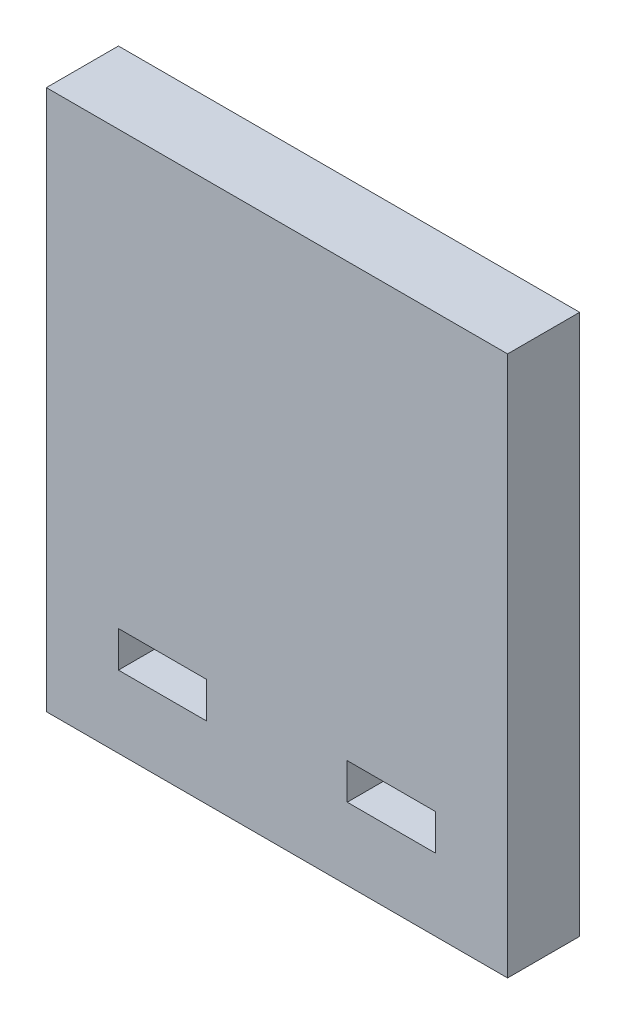
ISO-10303-21;
HEADER;
FILE_DESCRIPTION(('STEP AP214'),'2;1');
FILE_NAME('part.step','',(''),(''),'','','');
FILE_SCHEMA(('AUTOMOTIVE_DESIGN { 1 0 10303 214 1 1 1 1 }'));
ENDSEC;
DATA;
#1=APPLICATION_CONTEXT('core data for automotive mechanical design processes');
#2=APPLICATION_PROTOCOL_DEFINITION('international standard','automotive_design',2000,#1);
#3=PRODUCT_CONTEXT('',#1,'mechanical');
#4=PRODUCT('Part','Part','',(#3));
#5=PRODUCT_RELATED_PRODUCT_CATEGORY('part','',(#4));
#6=PRODUCT_DEFINITION_FORMATION('','',#4);
#7=PRODUCT_DEFINITION_CONTEXT('part definition',#1,'design');
#8=PRODUCT_DEFINITION('design','',#6,#7);
#9=PRODUCT_DEFINITION_SHAPE('','',#8);
#10=(LENGTH_UNIT() NAMED_UNIT(*) SI_UNIT(.MILLI.,.METRE.));
#11=(NAMED_UNIT(*) PLANE_ANGLE_UNIT() SI_UNIT($,.RADIAN.));
#12=(NAMED_UNIT(*) SI_UNIT($,.STERADIAN.) SOLID_ANGLE_UNIT());
#13=UNCERTAINTY_MEASURE_WITH_UNIT(LENGTH_MEASURE(1.E-05),#10,'distance_accuracy_value','');
#14=(GEOMETRIC_REPRESENTATION_CONTEXT(3) GLOBAL_UNCERTAINTY_ASSIGNED_CONTEXT((#13)) GLOBAL_UNIT_ASSIGNED_CONTEXT((#10,
#11,#12)) REPRESENTATION_CONTEXT('',''));
#15=CARTESIAN_POINT('',(0.,0.,0.));
#16=DIRECTION('',(0.,0.,1.));
#17=DIRECTION('',(1.,0.,0.));
#18=AXIS2_PLACEMENT_3D('',#15,#16,#17);
#19=CARTESIAN_POINT('',(0.,0.,20.));
#20=DIRECTION('',(0.,0.,-1.));
#21=DIRECTION('',(-1.,0.,0.));
#22=AXIS2_PLACEMENT_3D('',#19,#20,#21);
#23=PLANE('',#22);
#24=DIRECTION('',(0.,1.,0.));
#25=VECTOR('',#24,1.);
#26=CARTESIAN_POINT('',(44.,-55.,20.));
#27=LINE('',#26,#25);
#28=CARTESIAN_POINT('',(44.,-55.,20.));
#29=VERTEX_POINT('',#28);
#30=CARTESIAN_POINT('',(44.,-45.,20.));
#31=VERTEX_POINT('',#30);
#32=EDGE_CURVE('E183',#29,#31,#27,.T.);
#33=ORIENTED_EDGE('',*,*,#32,.F.);
#34=DIRECTION('',(1.,0.,0.));
#35=VECTOR('',#34,1.);
#36=CARTESIAN_POINT('',(44.,-55.,20.));
#37=LINE('',#36,#35);
#38=CARTESIAN_POINT('',(19.5,-55.,20.));
#39=VERTEX_POINT('',#38);
#40=EDGE_CURVE('E194',#39,#29,#37,.T.);
#41=ORIENTED_EDGE('',*,*,#40,.F.);
#42=DIRECTION('',(0.,-1.,0.));
#43=VECTOR('',#42,1.);
#44=CARTESIAN_POINT('',(19.5,-55.,20.));
#45=LINE('',#44,#43);
#46=CARTESIAN_POINT('',(19.5,-45.,20.));
#47=VERTEX_POINT('',#46);
#48=EDGE_CURVE('E190',#47,#39,#45,.T.);
#49=ORIENTED_EDGE('',*,*,#48,.F.);
#50=DIRECTION('',(-1.,0.,0.));
#51=VECTOR('',#50,1.);
#52=CARTESIAN_POINT('',(44.,-45.,20.));
#53=LINE('',#52,#51);
#54=EDGE_CURVE('E186',#31,#47,#53,.T.);
#55=ORIENTED_EDGE('',*,*,#54,.F.);
#56=EDGE_LOOP('',(#33,#41,#49,#55));
#57=FACE_BOUND('',#56,.T.);
#58=DIRECTION('',(0.,1.,0.));
#59=VECTOR('',#58,1.);
#60=CARTESIAN_POINT('',(64.,-75.,20.));
#61=LINE('',#60,#59);
#62=CARTESIAN_POINT('',(64.,-75.,20.));
#63=VERTEX_POINT('',#62);
#64=CARTESIAN_POINT('',(64.,75.,20.));
#65=VERTEX_POINT('',#64);
#66=EDGE_CURVE('E226',#63,#65,#61,.T.);
#67=ORIENTED_EDGE('',*,*,#66,.T.);
#68=DIRECTION('',(-1.,0.,0.));
#69=VECTOR('',#68,1.);
#70=CARTESIAN_POINT('',(-64.,75.,20.));
#71=LINE('',#70,#69);
#72=CARTESIAN_POINT('',(-64.,75.,20.));
#73=VERTEX_POINT('',#72);
#74=EDGE_CURVE('E230',#65,#73,#71,.T.);
#75=ORIENTED_EDGE('',*,*,#74,.T.);
#76=DIRECTION('',(0.,-1.,0.));
#77=VECTOR('',#76,1.);
#78=CARTESIAN_POINT('',(-64.,-75.,20.));
#79=LINE('',#78,#77);
#80=CARTESIAN_POINT('',(-64.,-75.,20.));
#81=VERTEX_POINT('',#80);
#82=EDGE_CURVE('E234',#73,#81,#79,.T.);
#83=ORIENTED_EDGE('',*,*,#82,.T.);
#84=DIRECTION('',(1.,0.,0.));
#85=VECTOR('',#84,1.);
#86=CARTESIAN_POINT('',(-64.,-75.,20.));
#87=LINE('',#86,#85);
#88=EDGE_CURVE('E237',#81,#63,#87,.T.);
#89=ORIENTED_EDGE('',*,*,#88,.T.);
#90=EDGE_LOOP('',(#67,#75,#83,#89));
#91=FACE_BOUND('',#90,.T.);
#92=DIRECTION('',(0.,-1.,0.));
#93=VECTOR('',#92,1.);
#94=CARTESIAN_POINT('',(-43.9999999999996,-55.0000000000002,20.));
#95=LINE('',#94,#93);
#96=CARTESIAN_POINT('',(-43.9999999999996,-45.0000000000002,20.));
#97=VERTEX_POINT('',#96);
#98=CARTESIAN_POINT('',(-43.9999999999996,-55.0000000000002,20.));
#99=VERTEX_POINT('',#98);
#100=EDGE_CURVE('E135',#97,#99,#95,.T.);
#101=ORIENTED_EDGE('',*,*,#100,.F.);
#102=DIRECTION('',(-1.,0.,0.));
#103=VECTOR('',#102,1.);
#104=CARTESIAN_POINT('',(-43.9999999999996,-45.0000000000002,20.));
#105=LINE('',#104,#103);
#106=CARTESIAN_POINT('',(-19.5,-45.,20.));
#107=VERTEX_POINT('',#106);
#108=EDGE_CURVE('E161',#107,#97,#105,.T.);
#109=ORIENTED_EDGE('',*,*,#108,.F.);
#110=DIRECTION('',(0.,1.,0.));
#111=VECTOR('',#110,1.);
#112=CARTESIAN_POINT('',(-19.5,-55.,20.));
#113=LINE('',#112,#111);
#114=CARTESIAN_POINT('',(-19.5,-55.,20.));
#115=VERTEX_POINT('',#114);
#116=EDGE_CURVE('E157',#115,#107,#113,.T.);
#117=ORIENTED_EDGE('',*,*,#116,.F.);
#118=DIRECTION('',(1.,0.,0.));
#119=VECTOR('',#118,1.);
#120=CARTESIAN_POINT('',(-43.9999999999996,-55.0000000000002,20.));
#121=LINE('',#120,#119);
#122=EDGE_CURVE('E144',#99,#115,#121,.T.);
#123=ORIENTED_EDGE('',*,*,#122,.F.);
#124=EDGE_LOOP('',(#101,#109,#117,#123));
#125=FACE_BOUND('',#124,.T.);
#126=ADVANCED_FACE('F45',(#57,#91,#125),#23,.F.);
#127=CARTESIAN_POINT('',(0.,0.,0.));
#128=DIRECTION('',(0.,0.,-1.));
#129=DIRECTION('',(-1.,0.,0.));
#130=AXIS2_PLACEMENT_3D('',#127,#128,#129);
#131=PLANE('',#130);
#132=DIRECTION('',(0.,1.,0.));
#133=VECTOR('',#132,1.);
#134=CARTESIAN_POINT('',(64.,-75.,0.));
#135=LINE('',#134,#133);
#136=CARTESIAN_POINT('',(64.,-75.,0.));
#137=VERTEX_POINT('',#136);
#138=CARTESIAN_POINT('',(64.,75.,0.));
#139=VERTEX_POINT('',#138);
#140=EDGE_CURVE('E225',#137,#139,#135,.T.);
#141=ORIENTED_EDGE('',*,*,#140,.F.);
#142=DIRECTION('',(1.,0.,0.));
#143=VECTOR('',#142,1.);
#144=CARTESIAN_POINT('',(-64.,-75.,0.));
#145=LINE('',#144,#143);
#146=CARTESIAN_POINT('',(-64.,-75.,0.));
#147=VERTEX_POINT('',#146);
#148=EDGE_CURVE('E231',#147,#137,#145,.T.);
#149=ORIENTED_EDGE('',*,*,#148,.F.);
#150=DIRECTION('',(0.,-1.,0.));
#151=VECTOR('',#150,1.);
#152=CARTESIAN_POINT('',(-64.,-75.,0.));
#153=LINE('',#152,#151);
#154=CARTESIAN_POINT('',(-64.,75.,0.));
#155=VERTEX_POINT('',#154);
#156=EDGE_CURVE('E247',#155,#147,#153,.T.);
#157=ORIENTED_EDGE('',*,*,#156,.F.);
#158=DIRECTION('',(-1.,0.,0.));
#159=VECTOR('',#158,1.);
#160=CARTESIAN_POINT('',(-64.,75.,0.));
#161=LINE('',#160,#159);
#162=EDGE_CURVE('E244',#139,#155,#161,.T.);
#163=ORIENTED_EDGE('',*,*,#162,.F.);
#164=EDGE_LOOP('',(#141,#149,#157,#163));
#165=FACE_BOUND('',#164,.T.);
#166=DIRECTION('',(1.,0.,0.));
#167=VECTOR('',#166,1.);
#168=CARTESIAN_POINT('',(44.,-55.,0.));
#169=LINE('',#168,#167);
#170=CARTESIAN_POINT('',(19.5,-55.,0.));
#171=VERTEX_POINT('',#170);
#172=CARTESIAN_POINT('',(44.,-55.,0.));
#173=VERTEX_POINT('',#172);
#174=EDGE_CURVE('E187',#171,#173,#169,.T.);
#175=ORIENTED_EDGE('',*,*,#174,.T.);
#176=DIRECTION('',(0.,1.,0.));
#177=VECTOR('',#176,1.);
#178=CARTESIAN_POINT('',(44.,-55.,0.));
#179=LINE('',#178,#177);
#180=CARTESIAN_POINT('',(44.,-45.,0.));
#181=VERTEX_POINT('',#180);
#182=EDGE_CURVE('E153',#173,#181,#179,.T.);
#183=ORIENTED_EDGE('',*,*,#182,.T.);
#184=DIRECTION('',(-1.,0.,0.));
#185=VECTOR('',#184,1.);
#186=CARTESIAN_POINT('',(44.,-45.,0.));
#187=LINE('',#186,#185);
#188=CARTESIAN_POINT('',(19.5,-45.,0.));
#189=VERTEX_POINT('',#188);
#190=EDGE_CURVE('E201',#181,#189,#187,.T.);
#191=ORIENTED_EDGE('',*,*,#190,.T.);
#192=DIRECTION('',(0.,-1.,0.));
#193=VECTOR('',#192,1.);
#194=CARTESIAN_POINT('',(19.5,-55.,0.));
#195=LINE('',#194,#193);
#196=EDGE_CURVE('E205',#189,#171,#195,.T.);
#197=ORIENTED_EDGE('',*,*,#196,.T.);
#198=EDGE_LOOP('',(#175,#183,#191,#197));
#199=FACE_BOUND('',#198,.T.);
#200=DIRECTION('',(-1.,0.,0.));
#201=VECTOR('',#200,1.);
#202=CARTESIAN_POINT('',(-43.9999999999996,-45.0000000000002,0.));
#203=LINE('',#202,#201);
#204=CARTESIAN_POINT('',(-19.5,-45.,0.));
#205=VERTEX_POINT('',#204);
#206=CARTESIAN_POINT('',(-43.9999999999996,-45.0000000000002,0.));
#207=VERTEX_POINT('',#206);
#208=EDGE_CURVE('E145',#205,#207,#203,.T.);
#209=ORIENTED_EDGE('',*,*,#208,.T.);
#210=DIRECTION('',(0.,-1.,0.));
#211=VECTOR('',#210,1.);
#212=CARTESIAN_POINT('',(-43.9999999999996,-55.0000000000002,0.));
#213=LINE('',#212,#211);
#214=CARTESIAN_POINT('',(-43.9999999999996,-55.0000000000002,0.));
#215=VERTEX_POINT('',#214);
#216=EDGE_CURVE('E69',#207,#215,#213,.T.);
#217=ORIENTED_EDGE('',*,*,#216,.T.);
#218=DIRECTION('',(1.,0.,0.));
#219=VECTOR('',#218,1.);
#220=CARTESIAN_POINT('',(-43.9999999999996,-55.0000000000002,0.));
#221=LINE('',#220,#219);
#222=CARTESIAN_POINT('',(-19.5,-55.,0.));
#223=VERTEX_POINT('',#222);
#224=EDGE_CURVE('E151',#215,#223,#221,.T.);
#225=ORIENTED_EDGE('',*,*,#224,.T.);
#226=DIRECTION('',(0.,1.,0.));
#227=VECTOR('',#226,1.);
#228=CARTESIAN_POINT('',(-19.5,-55.,0.));
#229=LINE('',#228,#227);
#230=EDGE_CURVE('E170',#223,#205,#229,.T.);
#231=ORIENTED_EDGE('',*,*,#230,.T.);
#232=EDGE_LOOP('',(#209,#217,#225,#231));
#233=FACE_BOUND('',#232,.T.);
#234=ADVANCED_FACE('F270',(#165,#199,#233),#131,.T.);
#235=CARTESIAN_POINT('',(64.,-75.,20.));
#236=DIRECTION('',(-1.,0.,0.));
#237=DIRECTION('',(0.,0.,1.));
#238=AXIS2_PLACEMENT_3D('',#235,#236,#237);
#239=PLANE('',#238);
#240=ORIENTED_EDGE('',*,*,#140,.T.);
#241=DIRECTION('',(0.,0.,-1.));
#242=VECTOR('',#241,1.);
#243=CARTESIAN_POINT('',(64.,75.,20.));
#244=LINE('',#243,#242);
#245=EDGE_CURVE('E11',#65,#139,#244,.T.);
#246=ORIENTED_EDGE('',*,*,#245,.F.);
#247=ORIENTED_EDGE('',*,*,#66,.F.);
#248=DIRECTION('',(0.,0.,-1.));
#249=VECTOR('',#248,1.);
#250=CARTESIAN_POINT('',(64.,-75.,20.));
#251=LINE('',#250,#249);
#252=EDGE_CURVE('E240',#63,#137,#251,.T.);
#253=ORIENTED_EDGE('',*,*,#252,.T.);
#254=EDGE_LOOP('',(#240,#246,#247,#253));
#255=FACE_BOUND('',#254,.T.);
#256=ADVANCED_FACE('F47',(#255),#239,.F.);
#257=CARTESIAN_POINT('',(-64.,75.,20.));
#258=DIRECTION('',(0.,-1.,0.));
#259=DIRECTION('',(0.,0.,-1.));
#260=AXIS2_PLACEMENT_3D('',#257,#258,#259);
#261=PLANE('',#260);
#262=ORIENTED_EDGE('',*,*,#162,.T.);
#263=DIRECTION('',(0.,0.,-1.));
#264=VECTOR('',#263,1.);
#265=CARTESIAN_POINT('',(-64.,75.,20.));
#266=LINE('',#265,#264);
#267=EDGE_CURVE('E54',#73,#155,#266,.T.);
#268=ORIENTED_EDGE('',*,*,#267,.F.);
#269=ORIENTED_EDGE('',*,*,#74,.F.);
#270=ORIENTED_EDGE('',*,*,#245,.T.);
#271=EDGE_LOOP('',(#262,#268,#269,#270));
#272=FACE_BOUND('',#271,.T.);
#273=ADVANCED_FACE('F280',(#272),#261,.F.);
#274=CARTESIAN_POINT('',(-64.,-75.,20.));
#275=DIRECTION('',(1.,0.,0.));
#276=DIRECTION('',(0.,0.,-1.));
#277=AXIS2_PLACEMENT_3D('',#274,#275,#276);
#278=PLANE('',#277);
#279=ORIENTED_EDGE('',*,*,#156,.T.);
#280=DIRECTION('',(0.,0.,-1.));
#281=VECTOR('',#280,1.);
#282=CARTESIAN_POINT('',(-64.,-75.,20.));
#283=LINE('',#282,#281);
#284=EDGE_CURVE('E255',#81,#147,#283,.T.);
#285=ORIENTED_EDGE('',*,*,#284,.F.);
#286=ORIENTED_EDGE('',*,*,#82,.F.);
#287=ORIENTED_EDGE('',*,*,#267,.T.);
#288=EDGE_LOOP('',(#279,#285,#286,#287));
#289=FACE_BOUND('',#288,.T.);
#290=ADVANCED_FACE('F264',(#289),#278,.F.);
#291=CARTESIAN_POINT('',(-64.,-75.,20.));
#292=DIRECTION('',(0.,1.,0.));
#293=DIRECTION('',(0.,0.,1.));
#294=AXIS2_PLACEMENT_3D('',#291,#292,#293);
#295=PLANE('',#294);
#296=ORIENTED_EDGE('',*,*,#148,.T.);
#297=ORIENTED_EDGE('',*,*,#252,.F.);
#298=ORIENTED_EDGE('',*,*,#88,.F.);
#299=ORIENTED_EDGE('',*,*,#284,.T.);
#300=EDGE_LOOP('',(#296,#297,#298,#299));
#301=FACE_BOUND('',#300,.T.);
#302=ADVANCED_FACE('F274',(#301),#295,.F.);
#303=CARTESIAN_POINT('',(44.,-55.,20.));
#304=DIRECTION('',(-1.,0.,0.));
#305=DIRECTION('',(0.,-1.,0.));
#306=AXIS2_PLACEMENT_3D('',#303,#304,#305);
#307=PLANE('',#306);
#308=ORIENTED_EDGE('',*,*,#182,.F.);
#309=DIRECTION('',(0.,0.,-1.));
#310=VECTOR('',#309,1.);
#311=CARTESIAN_POINT('',(44.,-55.,20.));
#312=LINE('',#311,#310);
#313=EDGE_CURVE('E197',#29,#173,#312,.T.);
#314=ORIENTED_EDGE('',*,*,#313,.F.);
#315=ORIENTED_EDGE('',*,*,#32,.T.);
#316=DIRECTION('',(0.,0.,-1.));
#317=VECTOR('',#316,1.);
#318=CARTESIAN_POINT('',(44.,-45.,20.));
#319=LINE('',#318,#317);
#320=EDGE_CURVE('E221',#31,#181,#319,.T.);
#321=ORIENTED_EDGE('',*,*,#320,.T.);
#322=EDGE_LOOP('',(#308,#314,#315,#321));
#323=FACE_BOUND('',#322,.T.);
#324=ADVANCED_FACE('F296',(#323),#307,.T.);
#325=CARTESIAN_POINT('',(44.,-45.,20.));
#326=DIRECTION('',(0.,-1.,0.));
#327=DIRECTION('',(1.,0.,0.));
#328=AXIS2_PLACEMENT_3D('',#325,#326,#327);
#329=PLANE('',#328);
#330=ORIENTED_EDGE('',*,*,#190,.F.);
#331=ORIENTED_EDGE('',*,*,#320,.F.);
#332=ORIENTED_EDGE('',*,*,#54,.T.);
#333=DIRECTION('',(0.,0.,-1.));
#334=VECTOR('',#333,1.);
#335=CARTESIAN_POINT('',(19.5,-45.,20.));
#336=LINE('',#335,#334);
#337=EDGE_CURVE('E218',#47,#189,#336,.T.);
#338=ORIENTED_EDGE('',*,*,#337,.T.);
#339=EDGE_LOOP('',(#330,#331,#332,#338));
#340=FACE_BOUND('',#339,.T.);
#341=ADVANCED_FACE('F303',(#340),#329,.T.);
#342=CARTESIAN_POINT('',(19.5,-55.,20.));
#343=DIRECTION('',(1.,0.,0.));
#344=DIRECTION('',(0.,0.,-1.));
#345=AXIS2_PLACEMENT_3D('',#342,#343,#344);
#346=PLANE('',#345);
#347=ORIENTED_EDGE('',*,*,#196,.F.);
#348=ORIENTED_EDGE('',*,*,#337,.F.);
#349=ORIENTED_EDGE('',*,*,#48,.T.);
#350=DIRECTION('',(0.,0.,-1.));
#351=VECTOR('',#350,1.);
#352=CARTESIAN_POINT('',(19.5,-55.,20.));
#353=LINE('',#352,#351);
#354=EDGE_CURVE('E215',#39,#171,#353,.T.);
#355=ORIENTED_EDGE('',*,*,#354,.T.);
#356=EDGE_LOOP('',(#347,#348,#349,#355));
#357=FACE_BOUND('',#356,.T.);
#358=ADVANCED_FACE('F308',(#357),#346,.T.);
#359=CARTESIAN_POINT('',(44.,-55.,20.));
#360=DIRECTION('',(0.,1.,0.));
#361=DIRECTION('',(-1.,0.,0.));
#362=AXIS2_PLACEMENT_3D('',#359,#360,#361);
#363=PLANE('',#362);
#364=ORIENTED_EDGE('',*,*,#174,.F.);
#365=ORIENTED_EDGE('',*,*,#354,.F.);
#366=ORIENTED_EDGE('',*,*,#40,.T.);
#367=ORIENTED_EDGE('',*,*,#313,.T.);
#368=EDGE_LOOP('',(#364,#365,#366,#367));
#369=FACE_BOUND('',#368,.T.);
#370=ADVANCED_FACE('F314',(#369),#363,.T.);
#371=CARTESIAN_POINT('',(-43.9999999999996,-55.0000000000002,20.));
#372=DIRECTION('',(1.,0.,0.));
#373=DIRECTION('',(0.,1.,0.));
#374=AXIS2_PLACEMENT_3D('',#371,#372,#373);
#375=PLANE('',#374);
#376=ORIENTED_EDGE('',*,*,#216,.F.);
#377=DIRECTION('',(0.,0.,-1.));
#378=VECTOR('',#377,1.);
#379=CARTESIAN_POINT('',(-43.9999999999996,-45.0000000000002,20.));
#380=LINE('',#379,#378);
#381=EDGE_CURVE('E139',#97,#207,#380,.T.);
#382=ORIENTED_EDGE('',*,*,#381,.F.);
#383=ORIENTED_EDGE('',*,*,#100,.T.);
#384=DIRECTION('',(0.,0.,-1.));
#385=VECTOR('',#384,1.);
#386=CARTESIAN_POINT('',(-43.9999999999996,-55.0000000000002,20.));
#387=LINE('',#386,#385);
#388=EDGE_CURVE('E138',#99,#215,#387,.T.);
#389=ORIENTED_EDGE('',*,*,#388,.T.);
#390=EDGE_LOOP('',(#376,#382,#383,#389));
#391=FACE_BOUND('',#390,.T.);
#392=ADVANCED_FACE('F137',(#391),#375,.T.);
#393=CARTESIAN_POINT('',(-43.9999999999996,-55.0000000000002,20.));
#394=DIRECTION('',(0.,1.,0.));
#395=DIRECTION('',(-1.,0.,0.));
#396=AXIS2_PLACEMENT_3D('',#393,#394,#395);
#397=PLANE('',#396);
#398=ORIENTED_EDGE('',*,*,#224,.F.);
#399=ORIENTED_EDGE('',*,*,#388,.F.);
#400=ORIENTED_EDGE('',*,*,#122,.T.);
#401=DIRECTION('',(0.,0.,-1.));
#402=VECTOR('',#401,1.);
#403=CARTESIAN_POINT('',(-19.5,-55.,20.));
#404=LINE('',#403,#402);
#405=EDGE_CURVE('E154',#115,#223,#404,.T.);
#406=ORIENTED_EDGE('',*,*,#405,.T.);
#407=EDGE_LOOP('',(#398,#399,#400,#406));
#408=FACE_BOUND('',#407,.T.);
#409=ADVANCED_FACE('F148',(#408),#397,.T.);
#410=CARTESIAN_POINT('',(-19.5,-55.,20.));
#411=DIRECTION('',(-1.,0.,0.));
#412=DIRECTION('',(0.,0.,1.));
#413=AXIS2_PLACEMENT_3D('',#410,#411,#412);
#414=PLANE('',#413);
#415=ORIENTED_EDGE('',*,*,#230,.F.);
#416=ORIENTED_EDGE('',*,*,#405,.F.);
#417=ORIENTED_EDGE('',*,*,#116,.T.);
#418=DIRECTION('',(0.,0.,-1.));
#419=VECTOR('',#418,1.);
#420=CARTESIAN_POINT('',(-19.5,-45.,20.));
#421=LINE('',#420,#419);
#422=EDGE_CURVE('E61',#107,#205,#421,.T.);
#423=ORIENTED_EDGE('',*,*,#422,.T.);
#424=EDGE_LOOP('',(#415,#416,#417,#423));
#425=FACE_BOUND('',#424,.T.);
#426=ADVANCED_FACE('F333',(#425),#414,.T.);
#427=CARTESIAN_POINT('',(-43.9999999999996,-45.0000000000002,20.));
#428=DIRECTION('',(0.,-1.,0.));
#429=DIRECTION('',(1.,0.,0.));
#430=AXIS2_PLACEMENT_3D('',#427,#428,#429);
#431=PLANE('',#430);
#432=ORIENTED_EDGE('',*,*,#208,.F.);
#433=ORIENTED_EDGE('',*,*,#422,.F.);
#434=ORIENTED_EDGE('',*,*,#108,.T.);
#435=ORIENTED_EDGE('',*,*,#381,.T.);
#436=EDGE_LOOP('',(#432,#433,#434,#435));
#437=FACE_BOUND('',#436,.T.);
#438=ADVANCED_FACE('F336',(#437),#431,.T.);
#439=CLOSED_SHELL('',(#126,#234,#256,#273,#290,#302,#324,#341,#358,#370,#392,#409,#426,#438));
#440=MANIFOLD_SOLID_BREP('B2',#439);
#441=ADVANCED_BREP_SHAPE_REPRESENTATION('',(#18,#440),#14);
#442=SHAPE_DEFINITION_REPRESENTATION(#9,#441);
ENDSEC;
END-ISO-10303-21;
